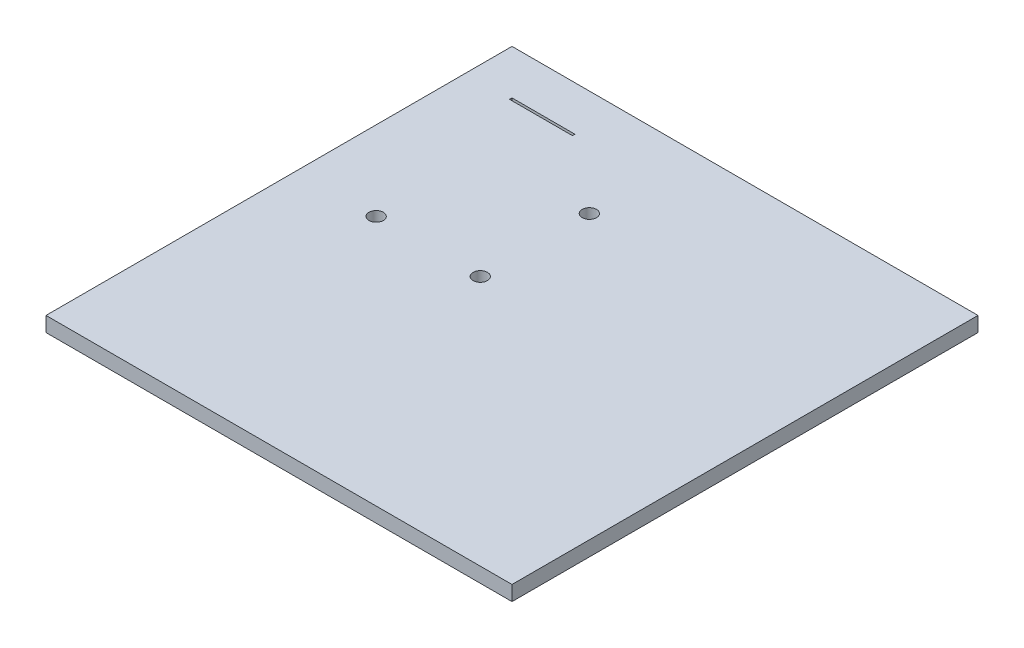
ISO-10303-21;
HEADER;
FILE_DESCRIPTION(('STEP AP214'),'2;1');
FILE_NAME('part.step','',(''),(''),'','','');
FILE_SCHEMA(('AUTOMOTIVE_DESIGN { 1 0 10303 214 1 1 1 1 }'));
ENDSEC;
DATA;
#1=APPLICATION_CONTEXT('core data for automotive mechanical design processes');
#2=APPLICATION_PROTOCOL_DEFINITION('international standard','automotive_design',2000,#1);
#3=PRODUCT_CONTEXT('',#1,'mechanical');
#4=PRODUCT('Part','Part','',(#3));
#5=PRODUCT_RELATED_PRODUCT_CATEGORY('part','',(#4));
#6=PRODUCT_DEFINITION_FORMATION('','',#4);
#7=PRODUCT_DEFINITION_CONTEXT('part definition',#1,'design');
#8=PRODUCT_DEFINITION('design','',#6,#7);
#9=PRODUCT_DEFINITION_SHAPE('','',#8);
#10=(LENGTH_UNIT() NAMED_UNIT(*) SI_UNIT(.MILLI.,.METRE.));
#11=(NAMED_UNIT(*) PLANE_ANGLE_UNIT() SI_UNIT($,.RADIAN.));
#12=(NAMED_UNIT(*) SI_UNIT($,.STERADIAN.) SOLID_ANGLE_UNIT());
#13=UNCERTAINTY_MEASURE_WITH_UNIT(LENGTH_MEASURE(1.E-05),#10,'distance_accuracy_value','');
#14=(GEOMETRIC_REPRESENTATION_CONTEXT(3) GLOBAL_UNCERTAINTY_ASSIGNED_CONTEXT((#13)) GLOBAL_UNIT_ASSIGNED_CONTEXT((#10,
#11,#12)) REPRESENTATION_CONTEXT('',''));
#15=CARTESIAN_POINT('',(0.,0.,0.));
#16=DIRECTION('',(0.,0.,1.));
#17=DIRECTION('',(1.,0.,0.));
#18=AXIS2_PLACEMENT_3D('',#15,#16,#17);
#19=CARTESIAN_POINT('',(50.,3.,50.));
#20=DIRECTION('',(0.,-1.,0.));
#21=DIRECTION('',(0.,0.,-1.));
#22=AXIS2_PLACEMENT_3D('',#19,#20,#21);
#23=PLANE('',#22);
#24=CARTESIAN_POINT('',(39.9999991059303,3.,46.3999994546175));
#25=DIRECTION('',(0.,-1.,0.));
#26=DIRECTION('',(1.,0.,0.));
#27=AXIS2_PLACEMENT_3D('',#24,#25,#26);
#28=CIRCLE('',#27,1.44999999992024);
#29=CARTESIAN_POINT('',(38.5499991060101,3.,46.3999994546175));
#30=VERTEX_POINT('',#29);
#31=EDGE_CURVE('E163',#30,#30,#28,.T.);
#32=ORIENTED_EDGE('',*,*,#31,.T.);
#33=EDGE_LOOP('',(#32));
#34=FACE_BOUND('',#33,.T.);
#35=CARTESIAN_POINT('',(18.9999995753169,3.,46.3999989628792));
#36=DIRECTION('',(0.,-1.,0.));
#37=DIRECTION('',(1.,0.,0.));
#38=AXIS2_PLACEMENT_3D('',#35,#36,#37);
#39=CIRCLE('',#38,1.44856083211659);
#40=CARTESIAN_POINT('',(17.5514387432003,3.,46.3999989628792));
#41=VERTEX_POINT('',#40);
#42=EDGE_CURVE('E152',#41,#41,#39,.T.);
#43=ORIENTED_EDGE('',*,*,#42,.T.);
#44=EDGE_LOOP('',(#43));
#45=FACE_BOUND('',#44,.T.);
#46=CARTESIAN_POINT('',(39.9999991059303,3.,24.3999994546175));
#47=DIRECTION('',(0.,-1.,0.));
#48=DIRECTION('',(1.,0.,0.));
#49=AXIS2_PLACEMENT_3D('',#46,#47,#48);
#50=CIRCLE('',#49,1.44999999992024);
#51=CARTESIAN_POINT('',(38.5499991060101,3.,24.3999994546175));
#52=VERTEX_POINT('',#51);
#53=EDGE_CURVE('E20',#52,#52,#50,.T.);
#54=ORIENTED_EDGE('',*,*,#53,.T.);
#55=EDGE_LOOP('',(#54));
#56=FACE_BOUND('',#55,.T.);
#57=DIRECTION('',(-1.,0.,0.));
#58=VECTOR('',#57,1.);
#59=CARTESIAN_POINT('',(12.000000089407,3.,12.5000001788139));
#60=LINE('',#59,#58);
#61=CARTESIAN_POINT('',(24.700000089407,3.,12.5000001788139));
#62=VERTEX_POINT('',#61);
#63=CARTESIAN_POINT('',(12.000000089407,3.,12.5000001788139));
#64=VERTEX_POINT('',#63);
#65=EDGE_CURVE('E115',#62,#64,#60,.T.);
#66=ORIENTED_EDGE('',*,*,#65,.T.);
#67=DIRECTION('',(0.,0.,-1.));
#68=VECTOR('',#67,1.);
#69=CARTESIAN_POINT('',(12.000000089407,3.,12.0000001788139));
#70=LINE('',#69,#68);
#71=CARTESIAN_POINT('',(12.000000089407,3.,12.0000001788139));
#72=VERTEX_POINT('',#71);
#73=EDGE_CURVE('E162',#64,#72,#70,.T.);
#74=ORIENTED_EDGE('',*,*,#73,.T.);
#75=DIRECTION('',(1.,0.,0.));
#76=VECTOR('',#75,1.);
#77=CARTESIAN_POINT('',(24.700000089407,3.,12.0000001788139));
#78=LINE('',#77,#76);
#79=CARTESIAN_POINT('',(24.700000089407,3.,12.0000001788139));
#80=VERTEX_POINT('',#79);
#81=EDGE_CURVE('E133',#72,#80,#78,.T.);
#82=ORIENTED_EDGE('',*,*,#81,.T.);
#83=DIRECTION('',(0.,0.,1.));
#84=VECTOR('',#83,1.);
#85=CARTESIAN_POINT('',(24.700000089407,3.,12.5000001788139));
#86=LINE('',#85,#84);
#87=EDGE_CURVE('E131',#80,#62,#86,.T.);
#88=ORIENTED_EDGE('',*,*,#87,.T.);
#89=EDGE_LOOP('',(#66,#74,#82,#88));
#90=FACE_BOUND('',#89,.T.);
#91=DIRECTION('',(-1.,0.,0.));
#92=VECTOR('',#91,1.);
#93=CARTESIAN_POINT('',(3.,3.,3.));
#94=LINE('',#93,#92);
#95=CARTESIAN_POINT('',(97.,3.,3.));
#96=VERTEX_POINT('',#95);
#97=CARTESIAN_POINT('',(3.,3.,3.));
#98=VERTEX_POINT('',#97);
#99=EDGE_CURVE('E11',#96,#98,#94,.T.);
#100=ORIENTED_EDGE('',*,*,#99,.T.);
#101=DIRECTION('',(0.,0.,1.));
#102=VECTOR('',#101,1.);
#103=CARTESIAN_POINT('',(3.,3.,97.));
#104=LINE('',#103,#102);
#105=CARTESIAN_POINT('',(3.,3.,97.));
#106=VERTEX_POINT('',#105);
#107=EDGE_CURVE('E215',#98,#106,#104,.T.);
#108=ORIENTED_EDGE('',*,*,#107,.T.);
#109=DIRECTION('',(1.,0.,0.));
#110=VECTOR('',#109,1.);
#111=CARTESIAN_POINT('',(97.,3.,97.));
#112=LINE('',#111,#110);
#113=CARTESIAN_POINT('',(97.,3.,97.));
#114=VERTEX_POINT('',#113);
#115=EDGE_CURVE('E158',#106,#114,#112,.T.);
#116=ORIENTED_EDGE('',*,*,#115,.T.);
#117=DIRECTION('',(0.,0.,-1.));
#118=VECTOR('',#117,1.);
#119=CARTESIAN_POINT('',(97.,3.,3.));
#120=LINE('',#119,#118);
#121=EDGE_CURVE('E172',#114,#96,#120,.T.);
#122=ORIENTED_EDGE('',*,*,#121,.T.);
#123=EDGE_LOOP('',(#100,#108,#116,#122));
#124=FACE_BOUND('',#123,.T.);
#125=ADVANCED_FACE('F17',(#34,#45,#56,#90,#124),#23,.F.);
#126=CARTESIAN_POINT('',(50.,0.,50.));
#127=DIRECTION('',(0.,-1.,0.));
#128=DIRECTION('',(0.,0.,-1.));
#129=AXIS2_PLACEMENT_3D('',#126,#127,#128);
#130=PLANE('',#129);
#131=CARTESIAN_POINT('',(39.9999991059303,0.,46.3999994546175));
#132=DIRECTION('',(0.,-1.,0.));
#133=DIRECTION('',(1.,0.,0.));
#134=AXIS2_PLACEMENT_3D('',#131,#132,#133);
#135=CIRCLE('',#134,1.44999999992024);
#136=CARTESIAN_POINT('',(38.5499991060101,0.,46.3999994546175));
#137=VERTEX_POINT('',#136);
#138=EDGE_CURVE('E194',#137,#137,#135,.T.);
#139=ORIENTED_EDGE('',*,*,#138,.F.);
#140=EDGE_LOOP('',(#139));
#141=FACE_BOUND('',#140,.T.);
#142=CARTESIAN_POINT('',(18.9999995753169,0.,46.3999989628792));
#143=DIRECTION('',(0.,-1.,0.));
#144=DIRECTION('',(1.,0.,0.));
#145=AXIS2_PLACEMENT_3D('',#142,#143,#144);
#146=CIRCLE('',#145,1.44856083211659);
#147=CARTESIAN_POINT('',(17.5514387432003,0.,46.3999989628792));
#148=VERTEX_POINT('',#147);
#149=EDGE_CURVE('E166',#148,#148,#146,.T.);
#150=ORIENTED_EDGE('',*,*,#149,.F.);
#151=EDGE_LOOP('',(#150));
#152=FACE_BOUND('',#151,.T.);
#153=CARTESIAN_POINT('',(39.9999991059303,0.,24.3999994546175));
#154=DIRECTION('',(0.,-1.,0.));
#155=DIRECTION('',(1.,0.,0.));
#156=AXIS2_PLACEMENT_3D('',#153,#154,#155);
#157=CIRCLE('',#156,1.44999999992024);
#158=CARTESIAN_POINT('',(38.5499991060101,0.,24.3999994546175));
#159=VERTEX_POINT('',#158);
#160=EDGE_CURVE('E177',#159,#159,#157,.T.);
#161=ORIENTED_EDGE('',*,*,#160,.F.);
#162=EDGE_LOOP('',(#161));
#163=FACE_BOUND('',#162,.T.);
#164=DIRECTION('',(1.,0.,0.));
#165=VECTOR('',#164,1.);
#166=CARTESIAN_POINT('',(12.000000089407,0.,12.5000001788139));
#167=LINE('',#166,#165);
#168=CARTESIAN_POINT('',(12.000000089407,0.,12.5000001788139));
#169=VERTEX_POINT('',#168);
#170=CARTESIAN_POINT('',(24.700000089407,0.,12.5000001788139));
#171=VERTEX_POINT('',#170);
#172=EDGE_CURVE('E128',#169,#171,#167,.T.);
#173=ORIENTED_EDGE('',*,*,#172,.T.);
#174=DIRECTION('',(0.,0.,-1.));
#175=VECTOR('',#174,1.);
#176=CARTESIAN_POINT('',(24.700000089407,0.,12.5000001788139));
#177=LINE('',#176,#175);
#178=CARTESIAN_POINT('',(24.700000089407,0.,12.0000001788139));
#179=VERTEX_POINT('',#178);
#180=EDGE_CURVE('E142',#171,#179,#177,.T.);
#181=ORIENTED_EDGE('',*,*,#180,.T.);
#182=DIRECTION('',(-1.,0.,0.));
#183=VECTOR('',#182,1.);
#184=CARTESIAN_POINT('',(24.700000089407,0.,12.0000001788139));
#185=LINE('',#184,#183);
#186=CARTESIAN_POINT('',(12.000000089407,0.,12.0000001788139));
#187=VERTEX_POINT('',#186);
#188=EDGE_CURVE('E184',#179,#187,#185,.T.);
#189=ORIENTED_EDGE('',*,*,#188,.T.);
#190=DIRECTION('',(0.,0.,1.));
#191=VECTOR('',#190,1.);
#192=CARTESIAN_POINT('',(12.000000089407,0.,12.0000001788139));
#193=LINE('',#192,#191);
#194=EDGE_CURVE('E196',#187,#169,#193,.T.);
#195=ORIENTED_EDGE('',*,*,#194,.T.);
#196=EDGE_LOOP('',(#173,#181,#189,#195));
#197=FACE_BOUND('',#196,.T.);
#198=DIRECTION('',(1.,0.,0.));
#199=VECTOR('',#198,1.);
#200=CARTESIAN_POINT('',(3.,0.,3.));
#201=LINE('',#200,#199);
#202=CARTESIAN_POINT('',(3.,0.,3.));
#203=VERTEX_POINT('',#202);
#204=CARTESIAN_POINT('',(97.,0.,3.));
#205=VERTEX_POINT('',#204);
#206=EDGE_CURVE('E27',#203,#205,#201,.T.);
#207=ORIENTED_EDGE('',*,*,#206,.T.);
#208=DIRECTION('',(0.,0.,1.));
#209=VECTOR('',#208,1.);
#210=CARTESIAN_POINT('',(97.,0.,3.));
#211=LINE('',#210,#209);
#212=CARTESIAN_POINT('',(97.,0.,97.));
#213=VERTEX_POINT('',#212);
#214=EDGE_CURVE('E127',#205,#213,#211,.T.);
#215=ORIENTED_EDGE('',*,*,#214,.T.);
#216=DIRECTION('',(-1.,0.,0.));
#217=VECTOR('',#216,1.);
#218=CARTESIAN_POINT('',(97.,0.,97.));
#219=LINE('',#218,#217);
#220=CARTESIAN_POINT('',(3.,0.,97.));
#221=VERTEX_POINT('',#220);
#222=EDGE_CURVE('E154',#213,#221,#219,.T.);
#223=ORIENTED_EDGE('',*,*,#222,.T.);
#224=DIRECTION('',(0.,0.,-1.));
#225=VECTOR('',#224,1.);
#226=CARTESIAN_POINT('',(3.,0.,97.));
#227=LINE('',#226,#225);
#228=EDGE_CURVE('E223',#221,#203,#227,.T.);
#229=ORIENTED_EDGE('',*,*,#228,.T.);
#230=EDGE_LOOP('',(#207,#215,#223,#229));
#231=FACE_BOUND('',#230,.T.);
#232=ADVANCED_FACE('F236',(#141,#152,#163,#197,#231),#130,.T.);
#233=CARTESIAN_POINT('',(97.,0.,3.));
#234=DIRECTION('',(0.,0.,-1.));
#235=DIRECTION('',(0.,-1.,0.));
#236=AXIS2_PLACEMENT_3D('',#233,#234,#235);
#237=PLANE('',#236);
#238=ORIENTED_EDGE('',*,*,#206,.F.);
#239=DIRECTION('',(0.,1.,0.));
#240=VECTOR('',#239,1.);
#241=CARTESIAN_POINT('',(3.,0.,3.));
#242=LINE('',#241,#240);
#243=EDGE_CURVE('E255',#203,#98,#242,.T.);
#244=ORIENTED_EDGE('',*,*,#243,.T.);
#245=ORIENTED_EDGE('',*,*,#99,.F.);
#246=DIRECTION('',(0.,1.,0.));
#247=VECTOR('',#246,1.);
#248=CARTESIAN_POINT('',(97.,0.,3.));
#249=LINE('',#248,#247);
#250=EDGE_CURVE('E168',#205,#96,#249,.T.);
#251=ORIENTED_EDGE('',*,*,#250,.F.);
#252=EDGE_LOOP('',(#238,#244,#245,#251));
#253=FACE_BOUND('',#252,.T.);
#254=ADVANCED_FACE('F278',(#253),#237,.T.);
#255=CARTESIAN_POINT('',(3.,0.,3.));
#256=DIRECTION('',(-1.,0.,0.));
#257=DIRECTION('',(0.,1.,0.));
#258=AXIS2_PLACEMENT_3D('',#255,#256,#257);
#259=PLANE('',#258);
#260=ORIENTED_EDGE('',*,*,#228,.F.);
#261=DIRECTION('',(0.,1.,0.));
#262=VECTOR('',#261,1.);
#263=CARTESIAN_POINT('',(3.,0.,97.));
#264=LINE('',#263,#262);
#265=EDGE_CURVE('E218',#221,#106,#264,.T.);
#266=ORIENTED_EDGE('',*,*,#265,.T.);
#267=ORIENTED_EDGE('',*,*,#107,.F.);
#268=ORIENTED_EDGE('',*,*,#243,.F.);
#269=EDGE_LOOP('',(#260,#266,#267,#268));
#270=FACE_BOUND('',#269,.T.);
#271=ADVANCED_FACE('F286',(#270),#259,.T.);
#272=CARTESIAN_POINT('',(3.,0.,97.));
#273=DIRECTION('',(0.,0.,1.));
#274=DIRECTION('',(1.,0.,0.));
#275=AXIS2_PLACEMENT_3D('',#272,#273,#274);
#276=PLANE('',#275);
#277=ORIENTED_EDGE('',*,*,#222,.F.);
#278=DIRECTION('',(0.,1.,0.));
#279=VECTOR('',#278,1.);
#280=CARTESIAN_POINT('',(97.,0.,97.));
#281=LINE('',#280,#279);
#282=EDGE_CURVE('E159',#213,#114,#281,.T.);
#283=ORIENTED_EDGE('',*,*,#282,.T.);
#284=ORIENTED_EDGE('',*,*,#115,.F.);
#285=ORIENTED_EDGE('',*,*,#265,.F.);
#286=EDGE_LOOP('',(#277,#283,#284,#285));
#287=FACE_BOUND('',#286,.T.);
#288=ADVANCED_FACE('F208',(#287),#276,.T.);
#289=CARTESIAN_POINT('',(97.,0.,97.));
#290=DIRECTION('',(1.,0.,0.));
#291=DIRECTION('',(0.,1.,0.));
#292=AXIS2_PLACEMENT_3D('',#289,#290,#291);
#293=PLANE('',#292);
#294=ORIENTED_EDGE('',*,*,#214,.F.);
#295=ORIENTED_EDGE('',*,*,#250,.T.);
#296=ORIENTED_EDGE('',*,*,#121,.F.);
#297=ORIENTED_EDGE('',*,*,#282,.F.);
#298=EDGE_LOOP('',(#294,#295,#296,#297));
#299=FACE_BOUND('',#298,.T.);
#300=ADVANCED_FACE('F212',(#299),#293,.T.);
#301=CARTESIAN_POINT('',(24.700000089407,0.,12.5000001788139));
#302=DIRECTION('',(0.,0.,-1.));
#303=DIRECTION('',(0.,-1.,0.));
#304=AXIS2_PLACEMENT_3D('',#301,#302,#303);
#305=PLANE('',#304);
#306=ORIENTED_EDGE('',*,*,#172,.F.);
#307=DIRECTION('',(0.,1.,0.));
#308=VECTOR('',#307,1.);
#309=CARTESIAN_POINT('',(12.000000089407,0.,12.5000001788139));
#310=LINE('',#309,#308);
#311=EDGE_CURVE('E123',#169,#64,#310,.T.);
#312=ORIENTED_EDGE('',*,*,#311,.T.);
#313=ORIENTED_EDGE('',*,*,#65,.F.);
#314=DIRECTION('',(0.,1.,0.));
#315=VECTOR('',#314,1.);
#316=CARTESIAN_POINT('',(24.700000089407,0.,12.5000001788139));
#317=LINE('',#316,#315);
#318=EDGE_CURVE('E120',#171,#62,#317,.T.);
#319=ORIENTED_EDGE('',*,*,#318,.F.);
#320=EDGE_LOOP('',(#306,#312,#313,#319));
#321=FACE_BOUND('',#320,.T.);
#322=ADVANCED_FACE('F118',(#321),#305,.T.);
#323=CARTESIAN_POINT('',(12.000000089407,0.,12.5000001788139));
#324=DIRECTION('',(1.,0.,0.));
#325=DIRECTION('',(0.,1.,0.));
#326=AXIS2_PLACEMENT_3D('',#323,#324,#325);
#327=PLANE('',#326);
#328=ORIENTED_EDGE('',*,*,#194,.F.);
#329=DIRECTION('',(0.,1.,0.));
#330=VECTOR('',#329,1.);
#331=CARTESIAN_POINT('',(12.000000089407,0.,12.0000001788139));
#332=LINE('',#331,#330);
#333=EDGE_CURVE('E190',#187,#72,#332,.T.);
#334=ORIENTED_EDGE('',*,*,#333,.T.);
#335=ORIENTED_EDGE('',*,*,#73,.F.);
#336=ORIENTED_EDGE('',*,*,#311,.F.);
#337=EDGE_LOOP('',(#328,#334,#335,#336));
#338=FACE_BOUND('',#337,.T.);
#339=ADVANCED_FACE('F240',(#338),#327,.T.);
#340=CARTESIAN_POINT('',(12.000000089407,0.,12.0000001788139));
#341=DIRECTION('',(0.,0.,1.));
#342=DIRECTION('',(1.,0.,0.));
#343=AXIS2_PLACEMENT_3D('',#340,#341,#342);
#344=PLANE('',#343);
#345=ORIENTED_EDGE('',*,*,#188,.F.);
#346=DIRECTION('',(0.,1.,0.));
#347=VECTOR('',#346,1.);
#348=CARTESIAN_POINT('',(24.700000089407,0.,12.0000001788139));
#349=LINE('',#348,#347);
#350=EDGE_CURVE('E138',#179,#80,#349,.T.);
#351=ORIENTED_EDGE('',*,*,#350,.T.);
#352=ORIENTED_EDGE('',*,*,#81,.F.);
#353=ORIENTED_EDGE('',*,*,#333,.F.);
#354=EDGE_LOOP('',(#345,#351,#352,#353));
#355=FACE_BOUND('',#354,.T.);
#356=ADVANCED_FACE('F242',(#355),#344,.T.);
#357=CARTESIAN_POINT('',(24.700000089407,0.,12.0000001788139));
#358=DIRECTION('',(-1.,0.,0.));
#359=DIRECTION('',(0.,0.,1.));
#360=AXIS2_PLACEMENT_3D('',#357,#358,#359);
#361=PLANE('',#360);
#362=ORIENTED_EDGE('',*,*,#180,.F.);
#363=ORIENTED_EDGE('',*,*,#318,.T.);
#364=ORIENTED_EDGE('',*,*,#87,.F.);
#365=ORIENTED_EDGE('',*,*,#350,.F.);
#366=EDGE_LOOP('',(#362,#363,#364,#365));
#367=FACE_BOUND('',#366,.T.);
#368=ADVANCED_FACE('F140',(#367),#361,.T.);
#369=CARTESIAN_POINT('',(39.9999991059303,0.,24.3999994546175));
#370=DIRECTION('',(0.,1.,0.));
#371=DIRECTION('',(1.,0.,0.));
#372=AXIS2_PLACEMENT_3D('',#369,#370,#371);
#373=CYLINDRICAL_SURFACE('',#372,1.44999999992024);
#374=ORIENTED_EDGE('',*,*,#160,.T.);
#375=DIRECTION('',(0.,1.,0.));
#376=VECTOR('',#375,1.);
#377=CARTESIAN_POINT('',(38.5499991060101,0.,24.3999994546175));
#378=LINE('',#377,#376);
#379=EDGE_CURVE('E181',#159,#52,#378,.T.);
#380=ORIENTED_EDGE('',*,*,#379,.T.);
#381=ORIENTED_EDGE('',*,*,#53,.F.);
#382=ORIENTED_EDGE('',*,*,#379,.F.);
#383=EDGE_LOOP('',(#374,#380,#381,#382));
#384=FACE_BOUND('',#383,.T.);
#385=ADVANCED_FACE('F274',(#384),#373,.F.);
#386=CARTESIAN_POINT('',(18.9999995753169,0.,46.3999989628792));
#387=DIRECTION('',(0.,1.,0.));
#388=DIRECTION('',(1.,0.,0.));
#389=AXIS2_PLACEMENT_3D('',#386,#387,#388);
#390=CYLINDRICAL_SURFACE('',#389,1.44856083211659);
#391=ORIENTED_EDGE('',*,*,#149,.T.);
#392=DIRECTION('',(0.,1.,0.));
#393=VECTOR('',#392,1.);
#394=CARTESIAN_POINT('',(17.5514387432003,0.,46.3999989628792));
#395=LINE('',#394,#393);
#396=EDGE_CURVE('E229',#148,#41,#395,.T.);
#397=ORIENTED_EDGE('',*,*,#396,.T.);
#398=ORIENTED_EDGE('',*,*,#42,.F.);
#399=ORIENTED_EDGE('',*,*,#396,.F.);
#400=EDGE_LOOP('',(#391,#397,#398,#399));
#401=FACE_BOUND('',#400,.T.);
#402=ADVANCED_FACE('F302',(#401),#390,.F.);
#403=CARTESIAN_POINT('',(39.9999991059303,0.,46.3999994546175));
#404=DIRECTION('',(0.,1.,0.));
#405=DIRECTION('',(1.,0.,0.));
#406=AXIS2_PLACEMENT_3D('',#403,#404,#405);
#407=CYLINDRICAL_SURFACE('',#406,1.44999999992024);
#408=ORIENTED_EDGE('',*,*,#138,.T.);
#409=DIRECTION('',(0.,1.,0.));
#410=VECTOR('',#409,1.);
#411=CARTESIAN_POINT('',(38.5499991060101,0.,46.3999994546175));
#412=LINE('',#411,#410);
#413=EDGE_CURVE('E167',#137,#30,#412,.T.);
#414=ORIENTED_EDGE('',*,*,#413,.T.);
#415=ORIENTED_EDGE('',*,*,#31,.F.);
#416=ORIENTED_EDGE('',*,*,#413,.F.);
#417=EDGE_LOOP('',(#408,#414,#415,#416));
#418=FACE_BOUND('',#417,.T.);
#419=ADVANCED_FACE('F299',(#418),#407,.F.);
#420=CLOSED_SHELL('',(#125,#232,#254,#271,#288,#300,#322,#339,#356,#368,#385,#402,#419));
#421=MANIFOLD_SOLID_BREP('B1',#420);
#422=ADVANCED_BREP_SHAPE_REPRESENTATION('',(#18,#421),#14);
#423=SHAPE_DEFINITION_REPRESENTATION(#9,#422);
ENDSEC;
END-ISO-10303-21;
